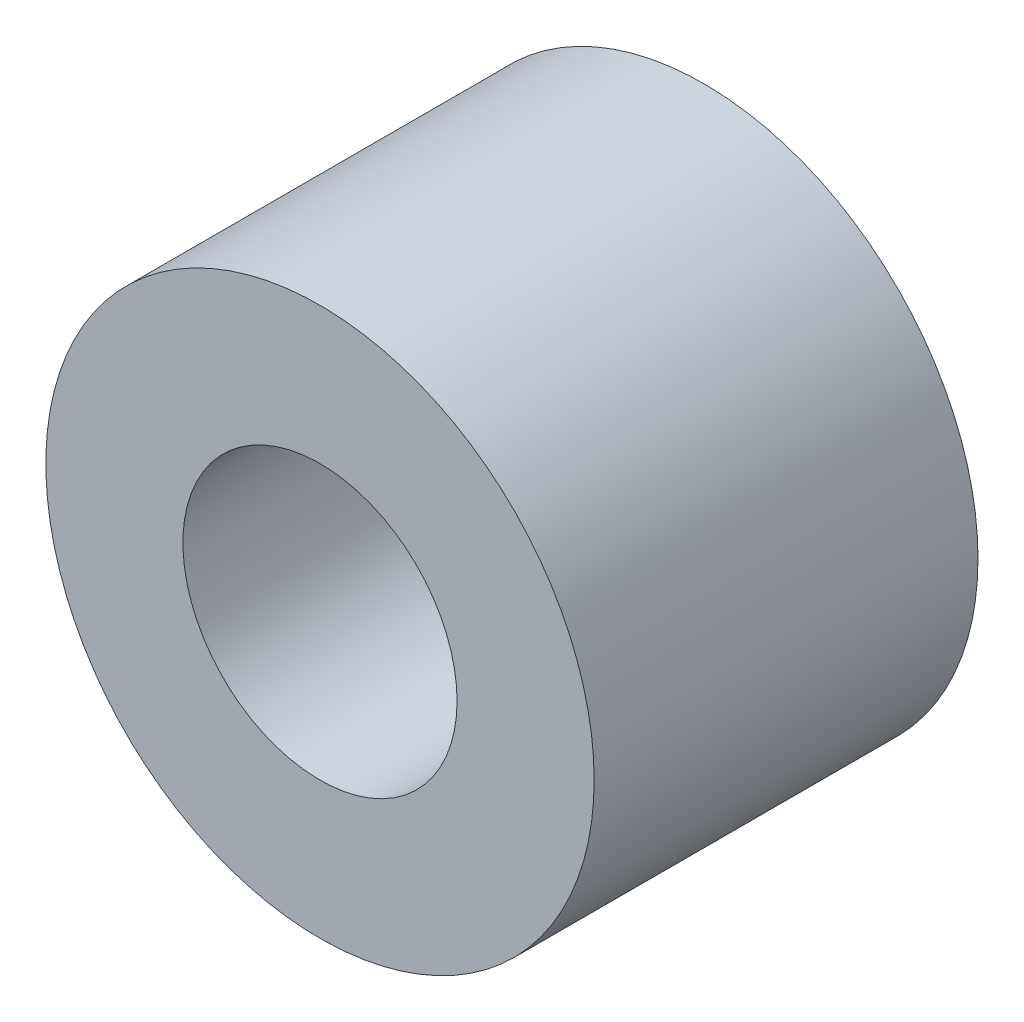
ISO-10303-21;
HEADER;
FILE_DESCRIPTION(('STEP AP214'),'2;1');
FILE_NAME('part.step','',(''),(''),'','','');
FILE_SCHEMA(('AUTOMOTIVE_DESIGN { 1 0 10303 214 1 1 1 1 }'));
ENDSEC;
DATA;
#1=APPLICATION_CONTEXT('core data for automotive mechanical design processes');
#2=APPLICATION_PROTOCOL_DEFINITION('international standard','automotive_design',2000,#1);
#3=PRODUCT_CONTEXT('',#1,'mechanical');
#4=PRODUCT('Part','Part','',(#3));
#5=PRODUCT_RELATED_PRODUCT_CATEGORY('part','',(#4));
#6=PRODUCT_DEFINITION_FORMATION('','',#4);
#7=PRODUCT_DEFINITION_CONTEXT('part definition',#1,'design');
#8=PRODUCT_DEFINITION('design','',#6,#7);
#9=PRODUCT_DEFINITION_SHAPE('','',#8);
#10=(LENGTH_UNIT() NAMED_UNIT(*) SI_UNIT(.MILLI.,.METRE.));
#11=(NAMED_UNIT(*) PLANE_ANGLE_UNIT() SI_UNIT($,.RADIAN.));
#12=(NAMED_UNIT(*) SI_UNIT($,.STERADIAN.) SOLID_ANGLE_UNIT());
#13=UNCERTAINTY_MEASURE_WITH_UNIT(LENGTH_MEASURE(1.E-05),#10,'distance_accuracy_value','');
#14=(GEOMETRIC_REPRESENTATION_CONTEXT(3) GLOBAL_UNCERTAINTY_ASSIGNED_CONTEXT((#13)) GLOBAL_UNIT_ASSIGNED_CONTEXT((#10,
#11,#12)) REPRESENTATION_CONTEXT('',''));
#15=CARTESIAN_POINT('',(0.,0.,0.));
#16=DIRECTION('',(0.,0.,1.));
#17=DIRECTION('',(1.,0.,0.));
#18=AXIS2_PLACEMENT_3D('',#15,#16,#17);
#19=CARTESIAN_POINT('',(0.,0.,7.));
#20=DIRECTION('',(0.,0.,-1.));
#21=DIRECTION('',(-1.,0.,0.));
#22=AXIS2_PLACEMENT_3D('',#19,#20,#21);
#23=CYLINDRICAL_SURFACE('',#22,5.);
#24=CARTESIAN_POINT('',(0.,0.,7.));
#25=DIRECTION('',(0.,0.,1.));
#26=DIRECTION('',(1.,0.,0.));
#27=AXIS2_PLACEMENT_3D('',#24,#25,#26);
#28=CIRCLE('',#27,5.);
#29=CARTESIAN_POINT('',(5.,0.,7.));
#30=VERTEX_POINT('',#29);
#31=EDGE_CURVE('E10',#30,#30,#28,.T.);
#32=ORIENTED_EDGE('',*,*,#31,.F.);
#33=EDGE_LOOP('',(#32));
#34=FACE_BOUND('',#33,.T.);
#35=CARTESIAN_POINT('',(0.,0.,0.));
#36=DIRECTION('',(0.,0.,1.));
#37=DIRECTION('',(1.,0.,0.));
#38=AXIS2_PLACEMENT_3D('',#35,#36,#37);
#39=CIRCLE('',#38,5.);
#40=CARTESIAN_POINT('',(5.,0.,0.));
#41=VERTEX_POINT('',#40);
#42=EDGE_CURVE('E38',#41,#41,#39,.T.);
#43=ORIENTED_EDGE('',*,*,#42,.T.);
#44=EDGE_LOOP('',(#43));
#45=FACE_BOUND('',#44,.T.);
#46=ADVANCED_FACE('F35',(#34,#45),#23,.T.);
#47=CARTESIAN_POINT('',(0.,0.,7.));
#48=DIRECTION('',(0.,0.,1.));
#49=DIRECTION('',(1.,0.,0.));
#50=AXIS2_PLACEMENT_3D('',#47,#48,#49);
#51=PLANE('',#50);
#52=CARTESIAN_POINT('',(0.,0.,7.));
#53=DIRECTION('',(0.,0.,1.));
#54=DIRECTION('',(1.,0.,0.));
#55=AXIS2_PLACEMENT_3D('',#52,#53,#54);
#56=CIRCLE('',#55,2.5);
#57=CARTESIAN_POINT('',(2.5,0.,7.));
#58=VERTEX_POINT('',#57);
#59=EDGE_CURVE('E49',#58,#58,#56,.T.);
#60=ORIENTED_EDGE('',*,*,#59,.F.);
#61=EDGE_LOOP('',(#60));
#62=FACE_BOUND('',#61,.T.);
#63=ORIENTED_EDGE('',*,*,#31,.T.);
#64=EDGE_LOOP('',(#63));
#65=FACE_BOUND('',#64,.T.);
#66=ADVANCED_FACE('F55',(#62,#65),#51,.T.);
#67=CARTESIAN_POINT('',(0.,0.,0.));
#68=DIRECTION('',(0.,0.,1.));
#69=DIRECTION('',(1.,0.,0.));
#70=AXIS2_PLACEMENT_3D('',#67,#68,#69);
#71=PLANE('',#70);
#72=CARTESIAN_POINT('',(0.,0.,0.));
#73=DIRECTION('',(0.,0.,1.));
#74=DIRECTION('',(1.,0.,0.));
#75=AXIS2_PLACEMENT_3D('',#72,#73,#74);
#76=CIRCLE('',#75,2.5);
#77=CARTESIAN_POINT('',(2.5,0.,0.));
#78=VERTEX_POINT('',#77);
#79=EDGE_CURVE('E45',#78,#78,#76,.T.);
#80=ORIENTED_EDGE('',*,*,#79,.T.);
#81=EDGE_LOOP('',(#80));
#82=FACE_BOUND('',#81,.T.);
#83=ORIENTED_EDGE('',*,*,#42,.F.);
#84=EDGE_LOOP('',(#83));
#85=FACE_BOUND('',#84,.T.);
#86=ADVANCED_FACE('F57',(#82,#85),#71,.F.);
#87=CARTESIAN_POINT('',(0.,0.,7.));
#88=DIRECTION('',(0.,0.,1.));
#89=DIRECTION('',(1.,0.,0.));
#90=AXIS2_PLACEMENT_3D('',#87,#88,#89);
#91=CYLINDRICAL_SURFACE('',#90,2.5);
#92=ORIENTED_EDGE('',*,*,#79,.F.);
#93=EDGE_LOOP('',(#92));
#94=FACE_BOUND('',#93,.T.);
#95=ORIENTED_EDGE('',*,*,#59,.T.);
#96=EDGE_LOOP('',(#95));
#97=FACE_BOUND('',#96,.T.);
#98=ADVANCED_FACE('F53',(#94,#97),#91,.F.);
#99=CLOSED_SHELL('',(#46,#66,#86,#98));
#100=MANIFOLD_SOLID_BREP('B2',#99);
#101=ADVANCED_BREP_SHAPE_REPRESENTATION('',(#18,#100),#14);
#102=SHAPE_DEFINITION_REPRESENTATION(#9,#101);
ENDSEC;
END-ISO-10303-21;
